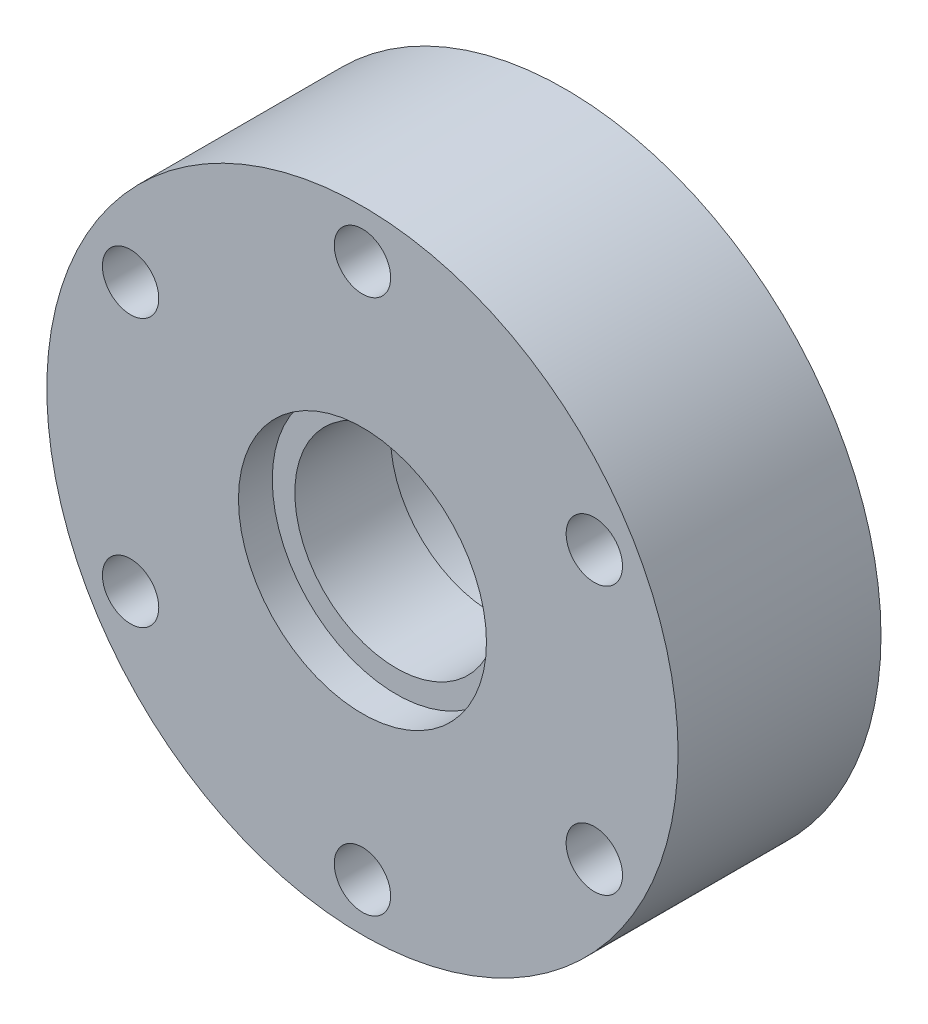
ISO-10303-21;
HEADER;
FILE_DESCRIPTION(('STEP AP214'),'2;1');
FILE_NAME('part.step','',(''),(''),'','','');
FILE_SCHEMA(('AUTOMOTIVE_DESIGN { 1 0 10303 214 1 1 1 1 }'));
ENDSEC;
DATA;
#1=APPLICATION_CONTEXT('core data for automotive mechanical design processes');
#2=APPLICATION_PROTOCOL_DEFINITION('international standard','automotive_design',2000,#1);
#3=PRODUCT_CONTEXT('',#1,'mechanical');
#4=PRODUCT('Part','Part','',(#3));
#5=PRODUCT_RELATED_PRODUCT_CATEGORY('part','',(#4));
#6=PRODUCT_DEFINITION_FORMATION('','',#4);
#7=PRODUCT_DEFINITION_CONTEXT('part definition',#1,'design');
#8=PRODUCT_DEFINITION('design','',#6,#7);
#9=PRODUCT_DEFINITION_SHAPE('','',#8);
#10=(LENGTH_UNIT() NAMED_UNIT(*) SI_UNIT(.MILLI.,.METRE.));
#11=(NAMED_UNIT(*) PLANE_ANGLE_UNIT() SI_UNIT($,.RADIAN.));
#12=(NAMED_UNIT(*) SI_UNIT($,.STERADIAN.) SOLID_ANGLE_UNIT());
#13=UNCERTAINTY_MEASURE_WITH_UNIT(LENGTH_MEASURE(1.E-05),#10,'distance_accuracy_value','');
#14=(GEOMETRIC_REPRESENTATION_CONTEXT(3) GLOBAL_UNCERTAINTY_ASSIGNED_CONTEXT((#13)) GLOBAL_UNIT_ASSIGNED_CONTEXT((#10,
#11,#12)) REPRESENTATION_CONTEXT('',''));
#15=CARTESIAN_POINT('',(0.,0.,0.));
#16=DIRECTION('',(0.,0.,1.));
#17=DIRECTION('',(1.,0.,0.));
#18=AXIS2_PLACEMENT_3D('',#15,#16,#17);
#19=CARTESIAN_POINT('',(0.,0.,-9.));
#20=DIRECTION('',(0.,0.,1.));
#21=DIRECTION('',(1.,0.,0.));
#22=AXIS2_PLACEMENT_3D('',#19,#20,#21);
#23=CYLINDRICAL_SURFACE('',#22,9.);
#24=CARTESIAN_POINT('',(0.,0.,6.));
#25=DIRECTION('',(0.,0.,1.));
#26=DIRECTION('',(1.,0.,0.));
#27=AXIS2_PLACEMENT_3D('',#24,#25,#26);
#28=CIRCLE('',#27,9.);
#29=CARTESIAN_POINT('',(9.,0.,6.));
#30=VERTEX_POINT('',#29);
#31=EDGE_CURVE('E50',#30,#30,#28,.T.);
#32=ORIENTED_EDGE('',*,*,#31,.T.);
#33=EDGE_LOOP('',(#32));
#34=FACE_BOUND('',#33,.T.);
#35=CARTESIAN_POINT('',(0.,0.,-2.5));
#36=DIRECTION('',(0.,0.,-1.));
#37=DIRECTION('',(-1.,0.,0.));
#38=AXIS2_PLACEMENT_3D('',#35,#36,#37);
#39=CIRCLE('',#38,9.);
#40=CARTESIAN_POINT('',(-9.,0.,-2.5));
#41=VERTEX_POINT('',#40);
#42=EDGE_CURVE('E36',#41,#41,#39,.F.);
#43=ORIENTED_EDGE('',*,*,#42,.F.);
#44=EDGE_LOOP('',(#43));
#45=FACE_BOUND('',#44,.T.);
#46=ADVANCED_FACE('F32',(#34,#45),#23,.F.);
#47=CARTESIAN_POINT('',(0.,0.,9.));
#48=DIRECTION('',(0.,0.,-1.));
#49=DIRECTION('',(-1.,0.,0.));
#50=AXIS2_PLACEMENT_3D('',#47,#48,#49);
#51=CYLINDRICAL_SURFACE('',#50,28.);
#52=CARTESIAN_POINT('',(0.,0.,9.));
#53=DIRECTION('',(0.,0.,1.));
#54=DIRECTION('',(1.,0.,0.));
#55=AXIS2_PLACEMENT_3D('',#52,#53,#54);
#56=CIRCLE('',#55,28.);
#57=CARTESIAN_POINT('',(28.,0.,9.));
#58=VERTEX_POINT('',#57);
#59=EDGE_CURVE('E10',#58,#58,#56,.T.);
#60=ORIENTED_EDGE('',*,*,#59,.F.);
#61=EDGE_LOOP('',(#60));
#62=FACE_BOUND('',#61,.T.);
#63=CARTESIAN_POINT('',(0.,0.,-9.));
#64=DIRECTION('',(0.,0.,1.));
#65=DIRECTION('',(1.,0.,0.));
#66=AXIS2_PLACEMENT_3D('',#63,#64,#65);
#67=CIRCLE('',#66,28.);
#68=CARTESIAN_POINT('',(28.,0.,-9.));
#69=VERTEX_POINT('',#68);
#70=EDGE_CURVE('E40',#69,#69,#67,.T.);
#71=ORIENTED_EDGE('',*,*,#70,.T.);
#72=EDGE_LOOP('',(#71));
#73=FACE_BOUND('',#72,.T.);
#74=ADVANCED_FACE('F34',(#62,#73),#51,.T.);
#75=CARTESIAN_POINT('',(0.,0.,9.));
#76=DIRECTION('',(0.,0.,1.));
#77=DIRECTION('',(1.,0.,0.));
#78=AXIS2_PLACEMENT_3D('',#75,#76,#77);
#79=PLANE('',#78);
#80=CARTESIAN_POINT('',(-20.5681033398804,-11.8750000000001,9.));
#81=DIRECTION('',(0.,0.,1.));
#82=DIRECTION('',(-0.500000000000004,0.866025403784436,0.));
#83=AXIS2_PLACEMENT_3D('',#80,#81,#82);
#84=CIRCLE('',#83,2.5);
#85=CARTESIAN_POINT('',(-21.8181033398804,-9.70993649053901,9.));
#86=VERTEX_POINT('',#85);
#87=EDGE_CURVE('E73',#86,#86,#84,.T.);
#88=ORIENTED_EDGE('',*,*,#87,.F.);
#89=EDGE_LOOP('',(#88));
#90=FACE_BOUND('',#89,.T.);
#91=CARTESIAN_POINT('',(0.,-23.75,9.));
#92=DIRECTION('',(0.,0.,1.));
#93=DIRECTION('',(-1.,0.,0.));
#94=AXIS2_PLACEMENT_3D('',#91,#92,#93);
#95=CIRCLE('',#94,2.5);
#96=CARTESIAN_POINT('',(-2.5,-23.75,9.));
#97=VERTEX_POINT('',#96);
#98=EDGE_CURVE('E87',#97,#97,#95,.T.);
#99=ORIENTED_EDGE('',*,*,#98,.F.);
#100=EDGE_LOOP('',(#99));
#101=FACE_BOUND('',#100,.T.);
#102=CARTESIAN_POINT('',(20.5681033398805,-11.8749999999998,9.));
#103=DIRECTION('',(0.,0.,1.));
#104=DIRECTION('',(-0.499999999999992,-0.866025403784443,0.));
#105=AXIS2_PLACEMENT_3D('',#102,#103,#104);
#106=CIRCLE('',#105,2.5);
#107=CARTESIAN_POINT('',(19.3181033398805,-14.0400635094609,9.));
#108=VERTEX_POINT('',#107);
#109=EDGE_CURVE('E81',#108,#108,#106,.T.);
#110=ORIENTED_EDGE('',*,*,#109,.F.);
#111=EDGE_LOOP('',(#110));
#112=FACE_BOUND('',#111,.T.);
#113=CARTESIAN_POINT('',(20.5681033398803,11.8750000000002,9.));
#114=DIRECTION('',(0.,0.,1.));
#115=DIRECTION('',(0.50000000000001,-0.866025403784433,0.));
#116=AXIS2_PLACEMENT_3D('',#113,#114,#115);
#117=CIRCLE('',#116,2.5);
#118=CARTESIAN_POINT('',(21.8181033398803,9.70993649053916,9.));
#119=VERTEX_POINT('',#118);
#120=EDGE_CURVE('E74',#119,#119,#117,.T.);
#121=ORIENTED_EDGE('',*,*,#120,.F.);
#122=EDGE_LOOP('',(#121));
#123=FACE_BOUND('',#122,.T.);
#124=CARTESIAN_POINT('',(-20.5681033398804,11.875,9.));
#125=DIRECTION('',(0.,0.,1.));
#126=DIRECTION('',(0.499999999999998,0.86602540378444,0.));
#127=AXIS2_PLACEMENT_3D('',#124,#125,#126);
#128=CIRCLE('',#127,2.5);
#129=CARTESIAN_POINT('',(-19.3181033398805,14.0400635094611,9.));
#130=VERTEX_POINT('',#129);
#131=EDGE_CURVE('E65',#130,#130,#128,.T.);
#132=ORIENTED_EDGE('',*,*,#131,.F.);
#133=EDGE_LOOP('',(#132));
#134=FACE_BOUND('',#133,.T.);
#135=CARTESIAN_POINT('',(0.,23.75,9.));
#136=DIRECTION('',(0.,0.,1.));
#137=DIRECTION('',(1.,0.,0.));
#138=AXIS2_PLACEMENT_3D('',#135,#136,#137);
#139=CIRCLE('',#138,2.5);
#140=CARTESIAN_POINT('',(2.5,23.75,9.));
#141=VERTEX_POINT('',#140);
#142=EDGE_CURVE('E62',#141,#141,#139,.T.);
#143=ORIENTED_EDGE('',*,*,#142,.F.);
#144=EDGE_LOOP('',(#143));
#145=FACE_BOUND('',#144,.T.);
#146=CARTESIAN_POINT('',(0.,0.,9.));
#147=DIRECTION('',(0.,0.,1.));
#148=DIRECTION('',(1.,0.,0.));
#149=AXIS2_PLACEMENT_3D('',#146,#147,#148);
#150=CIRCLE('',#149,11.);
#151=CARTESIAN_POINT('',(11.,0.,9.));
#152=VERTEX_POINT('',#151);
#153=EDGE_CURVE('E47',#152,#152,#150,.T.);
#154=ORIENTED_EDGE('',*,*,#153,.F.);
#155=EDGE_LOOP('',(#154));
#156=FACE_BOUND('',#155,.T.);
#157=ORIENTED_EDGE('',*,*,#59,.T.);
#158=EDGE_LOOP('',(#157));
#159=FACE_BOUND('',#158,.T.);
#160=ADVANCED_FACE('F108',(#90,#101,#112,#123,#134,#145,#156,#159),#79,.T.);
#161=CARTESIAN_POINT('',(0.,0.,-9.));
#162=DIRECTION('',(0.,0.,1.));
#163=DIRECTION('',(1.,0.,0.));
#164=AXIS2_PLACEMENT_3D('',#161,#162,#163);
#165=PLANE('',#164);
#166=CARTESIAN_POINT('',(-20.5681033398804,-11.8750000000001,-9.));
#167=DIRECTION('',(0.,0.,1.));
#168=DIRECTION('',(-0.500000000000004,0.866025403784436,0.));
#169=AXIS2_PLACEMENT_3D('',#166,#167,#168);
#170=CIRCLE('',#169,2.5);
#171=CARTESIAN_POINT('',(-21.8181033398804,-9.70993649053901,-9.));
#172=VERTEX_POINT('',#171);
#173=EDGE_CURVE('E90',#172,#172,#170,.T.);
#174=ORIENTED_EDGE('',*,*,#173,.T.);
#175=EDGE_LOOP('',(#174));
#176=FACE_BOUND('',#175,.T.);
#177=CARTESIAN_POINT('',(0.,-23.75,-9.));
#178=DIRECTION('',(0.,0.,1.));
#179=DIRECTION('',(-1.,0.,0.));
#180=AXIS2_PLACEMENT_3D('',#177,#178,#179);
#181=CIRCLE('',#180,2.5);
#182=CARTESIAN_POINT('',(-2.5,-23.75,-9.));
#183=VERTEX_POINT('',#182);
#184=EDGE_CURVE('E84',#183,#183,#181,.T.);
#185=ORIENTED_EDGE('',*,*,#184,.T.);
#186=EDGE_LOOP('',(#185));
#187=FACE_BOUND('',#186,.T.);
#188=CARTESIAN_POINT('',(20.5681033398805,-11.8749999999998,-9.));
#189=DIRECTION('',(0.,0.,1.));
#190=DIRECTION('',(-0.499999999999992,-0.866025403784443,0.));
#191=AXIS2_PLACEMENT_3D('',#188,#189,#190);
#192=CIRCLE('',#191,2.5);
#193=CARTESIAN_POINT('',(19.3181033398805,-14.0400635094609,-9.));
#194=VERTEX_POINT('',#193);
#195=EDGE_CURVE('E77',#194,#194,#192,.T.);
#196=ORIENTED_EDGE('',*,*,#195,.T.);
#197=EDGE_LOOP('',(#196));
#198=FACE_BOUND('',#197,.T.);
#199=CARTESIAN_POINT('',(20.5681033398803,11.8750000000002,-9.));
#200=DIRECTION('',(0.,0.,1.));
#201=DIRECTION('',(0.50000000000001,-0.866025403784433,0.));
#202=AXIS2_PLACEMENT_3D('',#199,#200,#201);
#203=CIRCLE('',#202,2.5);
#204=CARTESIAN_POINT('',(21.8181033398803,9.70993649053916,-9.));
#205=VERTEX_POINT('',#204);
#206=EDGE_CURVE('E78',#205,#205,#203,.T.);
#207=ORIENTED_EDGE('',*,*,#206,.T.);
#208=EDGE_LOOP('',(#207));
#209=FACE_BOUND('',#208,.T.);
#210=CARTESIAN_POINT('',(-20.5681033398804,11.875,-9.));
#211=DIRECTION('',(0.,0.,1.));
#212=DIRECTION('',(0.499999999999998,0.86602540378444,0.));
#213=AXIS2_PLACEMENT_3D('',#210,#211,#212);
#214=CIRCLE('',#213,2.5);
#215=CARTESIAN_POINT('',(-19.3181033398805,14.0400635094611,-9.));
#216=VERTEX_POINT('',#215);
#217=EDGE_CURVE('E70',#216,#216,#214,.T.);
#218=ORIENTED_EDGE('',*,*,#217,.T.);
#219=EDGE_LOOP('',(#218));
#220=FACE_BOUND('',#219,.T.);
#221=CARTESIAN_POINT('',(0.,23.75,-9.));
#222=DIRECTION('',(0.,0.,1.));
#223=DIRECTION('',(1.,0.,0.));
#224=AXIS2_PLACEMENT_3D('',#221,#222,#223);
#225=CIRCLE('',#224,2.5);
#226=CARTESIAN_POINT('',(2.5,23.75,-9.));
#227=VERTEX_POINT('',#226);
#228=EDGE_CURVE('E59',#227,#227,#225,.T.);
#229=ORIENTED_EDGE('',*,*,#228,.T.);
#230=EDGE_LOOP('',(#229));
#231=FACE_BOUND('',#230,.T.);
#232=CARTESIAN_POINT('',(0.,0.,-9.));
#233=DIRECTION('',(0.,0.,-1.));
#234=DIRECTION('',(-1.,0.,0.));
#235=AXIS2_PLACEMENT_3D('',#232,#233,#234);
#236=CIRCLE('',#235,11.);
#237=CARTESIAN_POINT('',(-11.,0.,-9.));
#238=VERTEX_POINT('',#237);
#239=EDGE_CURVE('E55',#238,#238,#236,.T.);
#240=ORIENTED_EDGE('',*,*,#239,.F.);
#241=EDGE_LOOP('',(#240));
#242=FACE_BOUND('',#241,.T.);
#243=ORIENTED_EDGE('',*,*,#70,.F.);
#244=EDGE_LOOP('',(#243));
#245=FACE_BOUND('',#244,.T.);
#246=ADVANCED_FACE('F98',(#176,#187,#198,#209,#220,#231,#242,#245),#165,.F.);
#247=CARTESIAN_POINT('',(0.,0.,6.));
#248=DIRECTION('',(0.,0.,1.));
#249=DIRECTION('',(1.,0.,0.));
#250=AXIS2_PLACEMENT_3D('',#247,#248,#249);
#251=CYLINDRICAL_SURFACE('',#250,11.);
#252=CARTESIAN_POINT('',(0.,0.,6.));
#253=DIRECTION('',(0.,0.,1.));
#254=DIRECTION('',(1.,0.,0.));
#255=AXIS2_PLACEMENT_3D('',#252,#253,#254);
#256=CIRCLE('',#255,11.);
#257=CARTESIAN_POINT('',(11.,0.,6.));
#258=VERTEX_POINT('',#257);
#259=EDGE_CURVE('E45',#258,#258,#256,.T.);
#260=ORIENTED_EDGE('',*,*,#259,.F.);
#261=EDGE_LOOP('',(#260));
#262=FACE_BOUND('',#261,.T.);
#263=ORIENTED_EDGE('',*,*,#153,.T.);
#264=EDGE_LOOP('',(#263));
#265=FACE_BOUND('',#264,.T.);
#266=ADVANCED_FACE('F124',(#262,#265),#251,.F.);
#267=CARTESIAN_POINT('',(0.,0.,6.));
#268=DIRECTION('',(0.,0.,1.));
#269=DIRECTION('',(1.,0.,0.));
#270=AXIS2_PLACEMENT_3D('',#267,#268,#269);
#271=PLANE('',#270);
#272=ORIENTED_EDGE('',*,*,#31,.F.);
#273=EDGE_LOOP('',(#272));
#274=FACE_BOUND('',#273,.T.);
#275=ORIENTED_EDGE('',*,*,#259,.T.);
#276=EDGE_LOOP('',(#275));
#277=FACE_BOUND('',#276,.T.);
#278=ADVANCED_FACE('F126',(#274,#277),#271,.T.);
#279=CARTESIAN_POINT('',(0.,0.,-2.5));
#280=DIRECTION('',(0.,0.,-1.));
#281=DIRECTION('',(-1.,0.,0.));
#282=AXIS2_PLACEMENT_3D('',#279,#280,#281);
#283=PLANE('',#282);
#284=CARTESIAN_POINT('',(0.,0.,-2.5));
#285=DIRECTION('',(0.,0.,-1.));
#286=DIRECTION('',(-1.,0.,0.));
#287=AXIS2_PLACEMENT_3D('',#284,#285,#286);
#288=CIRCLE('',#287,11.);
#289=CARTESIAN_POINT('',(-11.,0.,-2.5));
#290=VERTEX_POINT('',#289);
#291=EDGE_CURVE('E58',#290,#290,#288,.T.);
#292=ORIENTED_EDGE('',*,*,#291,.T.);
#293=EDGE_LOOP('',(#292));
#294=FACE_BOUND('',#293,.T.);
#295=ORIENTED_EDGE('',*,*,#42,.T.);
#296=EDGE_LOOP('',(#295));
#297=FACE_BOUND('',#296,.T.);
#298=ADVANCED_FACE('F133',(#294,#297),#283,.T.);
#299=CARTESIAN_POINT('',(0.,0.,-2.5));
#300=DIRECTION('',(0.,0.,-1.));
#301=DIRECTION('',(-1.,0.,0.));
#302=AXIS2_PLACEMENT_3D('',#299,#300,#301);
#303=CYLINDRICAL_SURFACE('',#302,11.);
#304=ORIENTED_EDGE('',*,*,#291,.F.);
#305=EDGE_LOOP('',(#304));
#306=FACE_BOUND('',#305,.T.);
#307=ORIENTED_EDGE('',*,*,#239,.T.);
#308=EDGE_LOOP('',(#307));
#309=FACE_BOUND('',#308,.T.);
#310=ADVANCED_FACE('F146',(#306,#309),#303,.F.);
#311=CARTESIAN_POINT('',(0.,23.75,-9.));
#312=DIRECTION('',(0.,0.,1.));
#313=DIRECTION('',(1.,0.,0.));
#314=AXIS2_PLACEMENT_3D('',#311,#312,#313);
#315=CYLINDRICAL_SURFACE('',#314,2.5);
#316=ORIENTED_EDGE('',*,*,#228,.F.);
#317=EDGE_LOOP('',(#316));
#318=FACE_BOUND('',#317,.T.);
#319=ORIENTED_EDGE('',*,*,#142,.T.);
#320=EDGE_LOOP('',(#319));
#321=FACE_BOUND('',#320,.T.);
#322=ADVANCED_FACE('F149',(#318,#321),#315,.F.);
#323=CARTESIAN_POINT('',(-20.5681033398804,11.875,-9.));
#324=DIRECTION('',(0.,0.,1.));
#325=DIRECTION('',(0.499999999999998,0.86602540378444,0.));
#326=AXIS2_PLACEMENT_3D('',#323,#324,#325);
#327=CYLINDRICAL_SURFACE('',#326,2.5);
#328=ORIENTED_EDGE('',*,*,#217,.F.);
#329=EDGE_LOOP('',(#328));
#330=FACE_BOUND('',#329,.T.);
#331=ORIENTED_EDGE('',*,*,#131,.T.);
#332=EDGE_LOOP('',(#331));
#333=FACE_BOUND('',#332,.T.);
#334=ADVANCED_FACE('F156',(#330,#333),#327,.F.);
#335=CARTESIAN_POINT('',(20.5681033398803,11.8750000000002,-9.));
#336=DIRECTION('',(0.,0.,1.));
#337=DIRECTION('',(0.50000000000001,-0.866025403784433,0.));
#338=AXIS2_PLACEMENT_3D('',#335,#336,#337);
#339=CYLINDRICAL_SURFACE('',#338,2.5);
#340=ORIENTED_EDGE('',*,*,#206,.F.);
#341=EDGE_LOOP('',(#340));
#342=FACE_BOUND('',#341,.T.);
#343=ORIENTED_EDGE('',*,*,#120,.T.);
#344=EDGE_LOOP('',(#343));
#345=FACE_BOUND('',#344,.T.);
#346=ADVANCED_FACE('F160',(#342,#345),#339,.F.);
#347=CARTESIAN_POINT('',(20.5681033398805,-11.8749999999998,-9.));
#348=DIRECTION('',(0.,0.,1.));
#349=DIRECTION('',(-0.499999999999992,-0.866025403784443,0.));
#350=AXIS2_PLACEMENT_3D('',#347,#348,#349);
#351=CYLINDRICAL_SURFACE('',#350,2.5);
#352=ORIENTED_EDGE('',*,*,#195,.F.);
#353=EDGE_LOOP('',(#352));
#354=FACE_BOUND('',#353,.T.);
#355=ORIENTED_EDGE('',*,*,#109,.T.);
#356=EDGE_LOOP('',(#355));
#357=FACE_BOUND('',#356,.T.);
#358=ADVANCED_FACE('F164',(#354,#357),#351,.F.);
#359=CARTESIAN_POINT('',(0.,-23.75,-9.));
#360=DIRECTION('',(0.,0.,1.));
#361=DIRECTION('',(-1.,0.,0.));
#362=AXIS2_PLACEMENT_3D('',#359,#360,#361);
#363=CYLINDRICAL_SURFACE('',#362,2.5);
#364=ORIENTED_EDGE('',*,*,#184,.F.);
#365=EDGE_LOOP('',(#364));
#366=FACE_BOUND('',#365,.T.);
#367=ORIENTED_EDGE('',*,*,#98,.T.);
#368=EDGE_LOOP('',(#367));
#369=FACE_BOUND('',#368,.T.);
#370=ADVANCED_FACE('F104',(#366,#369),#363,.F.);
#371=CARTESIAN_POINT('',(-20.5681033398804,-11.8750000000001,-9.));
#372=DIRECTION('',(0.,0.,1.));
#373=DIRECTION('',(-0.500000000000004,0.866025403784436,0.));
#374=AXIS2_PLACEMENT_3D('',#371,#372,#373);
#375=CYLINDRICAL_SURFACE('',#374,2.5);
#376=ORIENTED_EDGE('',*,*,#173,.F.);
#377=EDGE_LOOP('',(#376));
#378=FACE_BOUND('',#377,.T.);
#379=ORIENTED_EDGE('',*,*,#87,.T.);
#380=EDGE_LOOP('',(#379));
#381=FACE_BOUND('',#380,.T.);
#382=ADVANCED_FACE('F101',(#378,#381),#375,.F.);
#383=CLOSED_SHELL('',(#46,#74,#160,#246,#266,#278,#298,#310,#322,#334,#346,#358,#370,#382));
#384=MANIFOLD_SOLID_BREP('B2',#383);
#385=ADVANCED_BREP_SHAPE_REPRESENTATION('',(#18,#384),#14);
#386=SHAPE_DEFINITION_REPRESENTATION(#9,#385);
ENDSEC;
END-ISO-10303-21;
